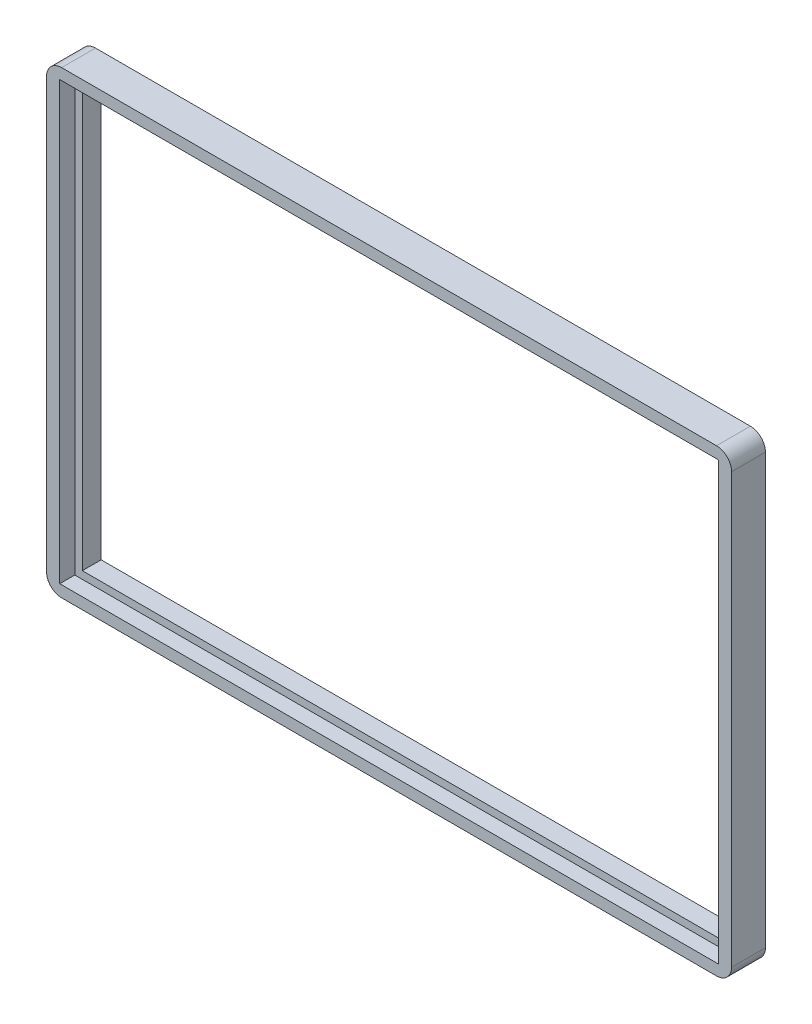
ISO-10303-21;
HEADER;
FILE_DESCRIPTION(('STEP AP214'),'2;1');
FILE_NAME('part.step','',(''),(''),'','','');
FILE_SCHEMA(('AUTOMOTIVE_DESIGN { 1 0 10303 214 1 1 1 1 }'));
ENDSEC;
DATA;
#1=APPLICATION_CONTEXT('core data for automotive mechanical design processes');
#2=APPLICATION_PROTOCOL_DEFINITION('international standard','automotive_design',2000,#1);
#3=PRODUCT_CONTEXT('',#1,'mechanical');
#4=PRODUCT('Part','Part','',(#3));
#5=PRODUCT_RELATED_PRODUCT_CATEGORY('part','',(#4));
#6=PRODUCT_DEFINITION_FORMATION('','',#4);
#7=PRODUCT_DEFINITION_CONTEXT('part definition',#1,'design');
#8=PRODUCT_DEFINITION('design','',#6,#7);
#9=PRODUCT_DEFINITION_SHAPE('','',#8);
#10=(LENGTH_UNIT() NAMED_UNIT(*) SI_UNIT(.MILLI.,.METRE.));
#11=(NAMED_UNIT(*) PLANE_ANGLE_UNIT() SI_UNIT($,.RADIAN.));
#12=(NAMED_UNIT(*) SI_UNIT($,.STERADIAN.) SOLID_ANGLE_UNIT());
#13=UNCERTAINTY_MEASURE_WITH_UNIT(LENGTH_MEASURE(1.E-05),#10,'distance_accuracy_value','');
#14=(GEOMETRIC_REPRESENTATION_CONTEXT(3) GLOBAL_UNCERTAINTY_ASSIGNED_CONTEXT((#13)) GLOBAL_UNIT_ASSIGNED_CONTEXT((#10,
#11,#12)) REPRESENTATION_CONTEXT('',''));
#15=CARTESIAN_POINT('',(0.,0.,0.));
#16=DIRECTION('',(0.,0.,1.));
#17=DIRECTION('',(1.,0.,0.));
#18=AXIS2_PLACEMENT_3D('',#15,#16,#17);
#19=CARTESIAN_POINT('',(45.5,30.5,4.5));
#20=DIRECTION('',(-1.,0.,0.));
#21=DIRECTION('',(0.,-1.,0.));
#22=AXIS2_PLACEMENT_3D('',#19,#20,#21);
#23=PLANE('',#22);
#24=DIRECTION('',(0.,1.,0.));
#25=VECTOR('',#24,1.);
#26=CARTESIAN_POINT('',(45.5,30.5,0.));
#27=LINE('',#26,#25);
#28=CARTESIAN_POINT('',(45.5,-28.5,0.));
#29=VERTEX_POINT('',#28);
#30=CARTESIAN_POINT('',(45.5,28.5,0.));
#31=VERTEX_POINT('',#30);
#32=EDGE_CURVE('E215',#29,#31,#27,.T.);
#33=ORIENTED_EDGE('',*,*,#32,.T.);
#34=DIRECTION('',(0.,0.,-1.));
#35=VECTOR('',#34,1.);
#36=CARTESIAN_POINT('',(45.5,28.5,4.5));
#37=LINE('',#36,#35);
#38=CARTESIAN_POINT('',(45.5,28.5,4.5));
#39=VERTEX_POINT('',#38);
#40=EDGE_CURVE('E258',#31,#39,#37,.F.);
#41=ORIENTED_EDGE('',*,*,#40,.T.);
#42=DIRECTION('',(0.,1.,0.));
#43=VECTOR('',#42,1.);
#44=CARTESIAN_POINT('',(45.5,30.5,4.5));
#45=LINE('',#44,#43);
#46=CARTESIAN_POINT('',(45.5,-28.5,4.5));
#47=VERTEX_POINT('',#46);
#48=EDGE_CURVE('E222',#47,#39,#45,.T.);
#49=ORIENTED_EDGE('',*,*,#48,.F.);
#50=DIRECTION('',(0.,0.,-1.));
#51=VECTOR('',#50,1.);
#52=CARTESIAN_POINT('',(45.5,-28.5,4.5));
#53=LINE('',#52,#51);
#54=EDGE_CURVE('E255',#47,#29,#53,.T.);
#55=ORIENTED_EDGE('',*,*,#54,.T.);
#56=EDGE_LOOP('',(#33,#41,#49,#55));
#57=FACE_BOUND('',#56,.T.);
#58=ADVANCED_FACE('F32',(#57),#23,.F.);
#59=CARTESIAN_POINT('',(-45.5000000000001,30.5,4.5));
#60=DIRECTION('',(0.,-1.,0.));
#61=DIRECTION('',(0.,0.,-1.));
#62=AXIS2_PLACEMENT_3D('',#59,#60,#61);
#63=PLANE('',#62);
#64=DIRECTION('',(-1.,0.,0.));
#65=VECTOR('',#64,1.);
#66=CARTESIAN_POINT('',(-45.5000000000001,30.5,4.5));
#67=LINE('',#66,#65);
#68=CARTESIAN_POINT('',(43.4999999999999,30.5,4.5));
#69=VERTEX_POINT('',#68);
#70=CARTESIAN_POINT('',(-43.5,30.5,4.5));
#71=VERTEX_POINT('',#70);
#72=EDGE_CURVE('E225',#69,#71,#67,.T.);
#73=ORIENTED_EDGE('',*,*,#72,.F.);
#74=DIRECTION('',(0.,0.,-1.));
#75=VECTOR('',#74,1.);
#76=CARTESIAN_POINT('',(43.4999999999999,30.5,4.5));
#77=LINE('',#76,#75);
#78=CARTESIAN_POINT('',(43.4999999999999,30.5,0.));
#79=VERTEX_POINT('',#78);
#80=EDGE_CURVE('E244',#69,#79,#77,.T.);
#81=ORIENTED_EDGE('',*,*,#80,.T.);
#82=DIRECTION('',(-1.,0.,0.));
#83=VECTOR('',#82,1.);
#84=CARTESIAN_POINT('',(-45.5000000000001,30.5,0.));
#85=LINE('',#84,#83);
#86=CARTESIAN_POINT('',(-43.5,30.5,0.));
#87=VERTEX_POINT('',#86);
#88=EDGE_CURVE('E236',#79,#87,#85,.T.);
#89=ORIENTED_EDGE('',*,*,#88,.T.);
#90=DIRECTION('',(0.,0.,-1.));
#91=VECTOR('',#90,1.);
#92=CARTESIAN_POINT('',(-43.5,30.5,4.5));
#93=LINE('',#92,#91);
#94=EDGE_CURVE('E233',#87,#71,#93,.F.);
#95=ORIENTED_EDGE('',*,*,#94,.T.);
#96=EDGE_LOOP('',(#73,#81,#89,#95));
#97=FACE_BOUND('',#96,.T.);
#98=ADVANCED_FACE('F300',(#97),#63,.F.);
#99=CARTESIAN_POINT('',(-45.5000000000001,30.5,4.5));
#100=DIRECTION('',(1.,0.,0.));
#101=DIRECTION('',(0.,1.,0.));
#102=AXIS2_PLACEMENT_3D('',#99,#100,#101);
#103=PLANE('',#102);
#104=DIRECTION('',(0.,-1.,0.));
#105=VECTOR('',#104,1.);
#106=CARTESIAN_POINT('',(-45.5000000000001,30.5,0.));
#107=LINE('',#106,#105);
#108=CARTESIAN_POINT('',(-45.5000000000001,28.5,0.));
#109=VERTEX_POINT('',#108);
#110=CARTESIAN_POINT('',(-45.5,-28.5,0.));
#111=VERTEX_POINT('',#110);
#112=EDGE_CURVE('E239',#109,#111,#107,.T.);
#113=ORIENTED_EDGE('',*,*,#112,.T.);
#114=DIRECTION('',(0.,0.,-1.));
#115=VECTOR('',#114,1.);
#116=CARTESIAN_POINT('',(-45.5,-28.5,4.5));
#117=LINE('',#116,#115);
#118=CARTESIAN_POINT('',(-45.5,-28.5,4.5));
#119=VERTEX_POINT('',#118);
#120=EDGE_CURVE('E11',#111,#119,#117,.F.);
#121=ORIENTED_EDGE('',*,*,#120,.T.);
#122=DIRECTION('',(0.,-1.,0.));
#123=VECTOR('',#122,1.);
#124=CARTESIAN_POINT('',(-45.5000000000001,30.5,4.5));
#125=LINE('',#124,#123);
#126=CARTESIAN_POINT('',(-45.5000000000001,28.5,4.5));
#127=VERTEX_POINT('',#126);
#128=EDGE_CURVE('E229',#127,#119,#125,.T.);
#129=ORIENTED_EDGE('',*,*,#128,.F.);
#130=DIRECTION('',(0.,0.,-1.));
#131=VECTOR('',#130,1.);
#132=CARTESIAN_POINT('',(-45.5000000000001,28.5,4.5));
#133=LINE('',#132,#131);
#134=EDGE_CURVE('E40',#127,#109,#133,.T.);
#135=ORIENTED_EDGE('',*,*,#134,.T.);
#136=EDGE_LOOP('',(#113,#121,#129,#135));
#137=FACE_BOUND('',#136,.T.);
#138=ADVANCED_FACE('F275',(#137),#103,.F.);
#139=CARTESIAN_POINT('',(-45.5,-30.5,4.5));
#140=DIRECTION('',(0.,1.,0.));
#141=DIRECTION('',(0.,0.,1.));
#142=AXIS2_PLACEMENT_3D('',#139,#140,#141);
#143=PLANE('',#142);
#144=DIRECTION('',(1.,0.,0.));
#145=VECTOR('',#144,1.);
#146=CARTESIAN_POINT('',(-45.5,-30.5,0.));
#147=LINE('',#146,#145);
#148=CARTESIAN_POINT('',(-43.5,-30.5,0.));
#149=VERTEX_POINT('',#148);
#150=CARTESIAN_POINT('',(43.5,-30.5,0.));
#151=VERTEX_POINT('',#150);
#152=EDGE_CURVE('E226',#149,#151,#147,.T.);
#153=ORIENTED_EDGE('',*,*,#152,.T.);
#154=DIRECTION('',(0.,0.,-1.));
#155=VECTOR('',#154,1.);
#156=CARTESIAN_POINT('',(43.5,-30.5,4.5));
#157=LINE('',#156,#155);
#158=CARTESIAN_POINT('',(43.5,-30.5,4.5));
#159=VERTEX_POINT('',#158);
#160=EDGE_CURVE('E47',#151,#159,#157,.F.);
#161=ORIENTED_EDGE('',*,*,#160,.T.);
#162=DIRECTION('',(1.,0.,0.));
#163=VECTOR('',#162,1.);
#164=CARTESIAN_POINT('',(-45.5,-30.5,4.5));
#165=LINE('',#164,#163);
#166=CARTESIAN_POINT('',(-43.5,-30.5,4.5));
#167=VERTEX_POINT('',#166);
#168=EDGE_CURVE('E231',#167,#159,#165,.T.);
#169=ORIENTED_EDGE('',*,*,#168,.F.);
#170=DIRECTION('',(0.,0.,-1.));
#171=VECTOR('',#170,1.);
#172=CARTESIAN_POINT('',(-43.5,-30.5,4.5));
#173=LINE('',#172,#171);
#174=EDGE_CURVE('E267',#167,#149,#173,.T.);
#175=ORIENTED_EDGE('',*,*,#174,.T.);
#176=EDGE_LOOP('',(#153,#161,#169,#175));
#177=FACE_BOUND('',#176,.T.);
#178=ADVANCED_FACE('F284',(#177),#143,.F.);
#179=CARTESIAN_POINT('',(0.,0.,4.5));
#180=DIRECTION('',(0.,0.,1.));
#181=DIRECTION('',(1.,0.,0.));
#182=AXIS2_PLACEMENT_3D('',#179,#180,#181);
#183=PLANE('',#182);
#184=DIRECTION('',(0.,1.,0.));
#185=VECTOR('',#184,1.);
#186=CARTESIAN_POINT('',(43.75,29.,4.5));
#187=LINE('',#186,#185);
#188=CARTESIAN_POINT('',(43.75,-29.,4.5));
#189=VERTEX_POINT('',#188);
#190=CARTESIAN_POINT('',(43.75,29.,4.5));
#191=VERTEX_POINT('',#190);
#192=EDGE_CURVE('E185',#189,#191,#187,.T.);
#193=ORIENTED_EDGE('',*,*,#192,.F.);
#194=DIRECTION('',(1.,0.,0.));
#195=VECTOR('',#194,1.);
#196=CARTESIAN_POINT('',(-43.75,-29.,4.5));
#197=LINE('',#196,#195);
#198=CARTESIAN_POINT('',(-43.75,-29.,4.5));
#199=VERTEX_POINT('',#198);
#200=EDGE_CURVE('E194',#199,#189,#197,.T.);
#201=ORIENTED_EDGE('',*,*,#200,.F.);
#202=DIRECTION('',(0.,-1.,0.));
#203=VECTOR('',#202,1.);
#204=CARTESIAN_POINT('',(-43.75,29.,4.5));
#205=LINE('',#204,#203);
#206=CARTESIAN_POINT('',(-43.75,29.,4.5));
#207=VERTEX_POINT('',#206);
#208=EDGE_CURVE('E208',#207,#199,#205,.T.);
#209=ORIENTED_EDGE('',*,*,#208,.F.);
#210=DIRECTION('',(-1.,0.,0.));
#211=VECTOR('',#210,1.);
#212=CARTESIAN_POINT('',(-43.75,29.,4.5));
#213=LINE('',#212,#211);
#214=EDGE_CURVE('E205',#191,#207,#213,.T.);
#215=ORIENTED_EDGE('',*,*,#214,.F.);
#216=EDGE_LOOP('',(#193,#201,#209,#215));
#217=FACE_BOUND('',#216,.T.);
#218=ORIENTED_EDGE('',*,*,#48,.T.);
#219=CARTESIAN_POINT('',(43.4999999999999,28.5,4.5));
#220=DIRECTION('',(0.,0.,1.));
#221=DIRECTION('',(1.,0.,0.));
#222=AXIS2_PLACEMENT_3D('',#219,#220,#221);
#223=CIRCLE('',#222,2.);
#224=EDGE_CURVE('E265',#39,#69,#223,.T.);
#225=ORIENTED_EDGE('',*,*,#224,.T.);
#226=ORIENTED_EDGE('',*,*,#72,.T.);
#227=CARTESIAN_POINT('',(-43.5,28.5,4.5));
#228=DIRECTION('',(0.,0.,1.));
#229=DIRECTION('',(1.,0.,0.));
#230=AXIS2_PLACEMENT_3D('',#227,#228,#229);
#231=CIRCLE('',#230,2.);
#232=EDGE_CURVE('E260',#71,#127,#231,.T.);
#233=ORIENTED_EDGE('',*,*,#232,.T.);
#234=ORIENTED_EDGE('',*,*,#128,.T.);
#235=CARTESIAN_POINT('',(-43.5,-28.5,4.5));
#236=DIRECTION('',(0.,0.,1.));
#237=DIRECTION('',(1.,0.,0.));
#238=AXIS2_PLACEMENT_3D('',#235,#236,#237);
#239=CIRCLE('',#238,2.);
#240=EDGE_CURVE('E54',#119,#167,#239,.T.);
#241=ORIENTED_EDGE('',*,*,#240,.T.);
#242=ORIENTED_EDGE('',*,*,#168,.T.);
#243=CARTESIAN_POINT('',(43.5,-28.5,4.5));
#244=DIRECTION('',(0.,0.,1.));
#245=DIRECTION('',(1.,0.,0.));
#246=AXIS2_PLACEMENT_3D('',#243,#244,#245);
#247=CIRCLE('',#246,2.);
#248=EDGE_CURVE('E263',#159,#47,#247,.T.);
#249=ORIENTED_EDGE('',*,*,#248,.T.);
#250=EDGE_LOOP('',(#218,#225,#226,#233,#234,#241,#242,#249));
#251=FACE_BOUND('',#250,.T.);
#252=ADVANCED_FACE('F286',(#217,#251),#183,.T.);
#253=CARTESIAN_POINT('',(0.,0.,0.));
#254=DIRECTION('',(0.,0.,1.));
#255=DIRECTION('',(1.,0.,0.));
#256=AXIS2_PLACEMENT_3D('',#253,#254,#255);
#257=PLANE('',#256);
#258=DIRECTION('',(1.,0.,0.));
#259=VECTOR('',#258,1.);
#260=CARTESIAN_POINT('',(-42.75,-28.,0.));
#261=LINE('',#260,#259);
#262=CARTESIAN_POINT('',(-42.75,-28.,0.));
#263=VERTEX_POINT('',#262);
#264=CARTESIAN_POINT('',(42.75,-28.,0.));
#265=VERTEX_POINT('',#264);
#266=EDGE_CURVE('E158',#263,#265,#261,.T.);
#267=ORIENTED_EDGE('',*,*,#266,.T.);
#268=DIRECTION('',(0.,1.,0.));
#269=VECTOR('',#268,1.);
#270=CARTESIAN_POINT('',(42.75,28.,0.));
#271=LINE('',#270,#269);
#272=CARTESIAN_POINT('',(42.75,28.,0.));
#273=VERTEX_POINT('',#272);
#274=EDGE_CURVE('E150',#265,#273,#271,.T.);
#275=ORIENTED_EDGE('',*,*,#274,.T.);
#276=DIRECTION('',(-1.,0.,0.));
#277=VECTOR('',#276,1.);
#278=CARTESIAN_POINT('',(-42.75,28.,0.));
#279=LINE('',#278,#277);
#280=CARTESIAN_POINT('',(-42.75,28.,0.));
#281=VERTEX_POINT('',#280);
#282=EDGE_CURVE('E162',#273,#281,#279,.T.);
#283=ORIENTED_EDGE('',*,*,#282,.T.);
#284=DIRECTION('',(0.,-1.,0.));
#285=VECTOR('',#284,1.);
#286=CARTESIAN_POINT('',(-42.75,28.,0.));
#287=LINE('',#286,#285);
#288=EDGE_CURVE('E166',#281,#263,#287,.T.);
#289=ORIENTED_EDGE('',*,*,#288,.T.);
#290=EDGE_LOOP('',(#267,#275,#283,#289));
#291=FACE_BOUND('',#290,.T.);
#292=ORIENTED_EDGE('',*,*,#88,.F.);
#293=CARTESIAN_POINT('',(43.4999999999999,28.5,0.));
#294=DIRECTION('',(0.,0.,1.));
#295=DIRECTION('',(1.,0.,0.));
#296=AXIS2_PLACEMENT_3D('',#293,#294,#295);
#297=CIRCLE('',#296,2.);
#298=EDGE_CURVE('E253',#79,#31,#297,.F.);
#299=ORIENTED_EDGE('',*,*,#298,.T.);
#300=ORIENTED_EDGE('',*,*,#32,.F.);
#301=CARTESIAN_POINT('',(43.5,-28.5,0.));
#302=DIRECTION('',(0.,0.,1.));
#303=DIRECTION('',(1.,0.,0.));
#304=AXIS2_PLACEMENT_3D('',#301,#302,#303);
#305=CIRCLE('',#304,2.);
#306=EDGE_CURVE('E251',#29,#151,#305,.F.);
#307=ORIENTED_EDGE('',*,*,#306,.T.);
#308=ORIENTED_EDGE('',*,*,#152,.F.);
#309=CARTESIAN_POINT('',(-43.5,-28.5,0.));
#310=DIRECTION('',(0.,0.,1.));
#311=DIRECTION('',(1.,0.,0.));
#312=AXIS2_PLACEMENT_3D('',#309,#310,#311);
#313=CIRCLE('',#312,2.);
#314=EDGE_CURVE('E249',#149,#111,#313,.F.);
#315=ORIENTED_EDGE('',*,*,#314,.T.);
#316=ORIENTED_EDGE('',*,*,#112,.F.);
#317=CARTESIAN_POINT('',(-43.5,28.5,0.));
#318=DIRECTION('',(0.,0.,1.));
#319=DIRECTION('',(1.,0.,0.));
#320=AXIS2_PLACEMENT_3D('',#317,#318,#319);
#321=CIRCLE('',#320,2.);
#322=EDGE_CURVE('E247',#109,#87,#321,.F.);
#323=ORIENTED_EDGE('',*,*,#322,.T.);
#324=EDGE_LOOP('',(#292,#299,#300,#307,#308,#315,#316,#323));
#325=FACE_BOUND('',#324,.T.);
#326=ADVANCED_FACE('F168',(#291,#325),#257,.F.);
#327=CARTESIAN_POINT('',(43.75,29.,2.5));
#328=DIRECTION('',(1.,0.,0.));
#329=DIRECTION('',(0.,1.,0.));
#330=AXIS2_PLACEMENT_3D('',#327,#328,#329);
#331=PLANE('',#330);
#332=ORIENTED_EDGE('',*,*,#192,.T.);
#333=DIRECTION('',(0.,0.,1.));
#334=VECTOR('',#333,1.);
#335=CARTESIAN_POINT('',(43.75,29.,2.5));
#336=LINE('',#335,#334);
#337=CARTESIAN_POINT('',(43.75,29.,2.5));
#338=VERTEX_POINT('',#337);
#339=EDGE_CURVE('E203',#338,#191,#336,.T.);
#340=ORIENTED_EDGE('',*,*,#339,.F.);
#341=DIRECTION('',(0.,1.,0.));
#342=VECTOR('',#341,1.);
#343=CARTESIAN_POINT('',(43.75,29.,2.5));
#344=LINE('',#343,#342);
#345=CARTESIAN_POINT('',(43.75,-29.,2.5));
#346=VERTEX_POINT('',#345);
#347=EDGE_CURVE('E190',#346,#338,#344,.T.);
#348=ORIENTED_EDGE('',*,*,#347,.F.);
#349=DIRECTION('',(0.,0.,1.));
#350=VECTOR('',#349,1.);
#351=CARTESIAN_POINT('',(43.75,-29.,2.5));
#352=LINE('',#351,#350);
#353=EDGE_CURVE('E213',#346,#189,#352,.T.);
#354=ORIENTED_EDGE('',*,*,#353,.T.);
#355=EDGE_LOOP('',(#332,#340,#348,#354));
#356=FACE_BOUND('',#355,.T.);
#357=ADVANCED_FACE('F406',(#356),#331,.F.);
#358=CARTESIAN_POINT('',(-43.75,-29.,2.5));
#359=DIRECTION('',(0.,-1.,0.));
#360=DIRECTION('',(0.,0.,-1.));
#361=AXIS2_PLACEMENT_3D('',#358,#359,#360);
#362=PLANE('',#361);
#363=ORIENTED_EDGE('',*,*,#200,.T.);
#364=ORIENTED_EDGE('',*,*,#353,.F.);
#365=DIRECTION('',(1.,0.,0.));
#366=VECTOR('',#365,1.);
#367=CARTESIAN_POINT('',(-43.75,-29.,2.5));
#368=LINE('',#367,#366);
#369=CARTESIAN_POINT('',(-43.75,-29.,2.5));
#370=VERTEX_POINT('',#369);
#371=EDGE_CURVE('E200',#370,#346,#368,.T.);
#372=ORIENTED_EDGE('',*,*,#371,.F.);
#373=DIRECTION('',(0.,0.,1.));
#374=VECTOR('',#373,1.);
#375=CARTESIAN_POINT('',(-43.75,-29.,2.5));
#376=LINE('',#375,#374);
#377=EDGE_CURVE('E216',#370,#199,#376,.T.);
#378=ORIENTED_EDGE('',*,*,#377,.T.);
#379=EDGE_LOOP('',(#363,#364,#372,#378));
#380=FACE_BOUND('',#379,.T.);
#381=ADVANCED_FACE('F397',(#380),#362,.F.);
#382=CARTESIAN_POINT('',(-43.75,29.,2.5));
#383=DIRECTION('',(-1.,0.,0.));
#384=DIRECTION('',(0.,-1.,0.));
#385=AXIS2_PLACEMENT_3D('',#382,#383,#384);
#386=PLANE('',#385);
#387=ORIENTED_EDGE('',*,*,#208,.T.);
#388=ORIENTED_EDGE('',*,*,#377,.F.);
#389=DIRECTION('',(0.,-1.,0.));
#390=VECTOR('',#389,1.);
#391=CARTESIAN_POINT('',(-43.75,29.,2.5));
#392=LINE('',#391,#390);
#393=CARTESIAN_POINT('',(-43.75,29.,2.5));
#394=VERTEX_POINT('',#393);
#395=EDGE_CURVE('E197',#394,#370,#392,.T.);
#396=ORIENTED_EDGE('',*,*,#395,.F.);
#397=DIRECTION('',(0.,0.,1.));
#398=VECTOR('',#397,1.);
#399=CARTESIAN_POINT('',(-43.75,29.,2.5));
#400=LINE('',#399,#398);
#401=EDGE_CURVE('E218',#394,#207,#400,.T.);
#402=ORIENTED_EDGE('',*,*,#401,.T.);
#403=EDGE_LOOP('',(#387,#388,#396,#402));
#404=FACE_BOUND('',#403,.T.);
#405=ADVANCED_FACE('F388',(#404),#386,.F.);
#406=CARTESIAN_POINT('',(-43.75,29.,2.5));
#407=DIRECTION('',(0.,1.,0.));
#408=DIRECTION('',(0.,0.,1.));
#409=AXIS2_PLACEMENT_3D('',#406,#407,#408);
#410=PLANE('',#409);
#411=ORIENTED_EDGE('',*,*,#214,.T.);
#412=ORIENTED_EDGE('',*,*,#401,.F.);
#413=DIRECTION('',(-1.,0.,0.));
#414=VECTOR('',#413,1.);
#415=CARTESIAN_POINT('',(-43.75,29.,2.5));
#416=LINE('',#415,#414);
#417=EDGE_CURVE('E193',#338,#394,#416,.T.);
#418=ORIENTED_EDGE('',*,*,#417,.F.);
#419=ORIENTED_EDGE('',*,*,#339,.T.);
#420=EDGE_LOOP('',(#411,#412,#418,#419));
#421=FACE_BOUND('',#420,.T.);
#422=ADVANCED_FACE('F379',(#421),#410,.F.);
#423=CARTESIAN_POINT('',(0.,0.,2.5));
#424=DIRECTION('',(0.,0.,1.));
#425=DIRECTION('',(1.,0.,0.));
#426=AXIS2_PLACEMENT_3D('',#423,#424,#425);
#427=PLANE('',#426);
#428=DIRECTION('',(0.,1.,0.));
#429=VECTOR('',#428,1.);
#430=CARTESIAN_POINT('',(42.75,28.,2.5));
#431=LINE('',#430,#429);
#432=CARTESIAN_POINT('',(42.75,-28.,2.5));
#433=VERTEX_POINT('',#432);
#434=CARTESIAN_POINT('',(42.75,28.,2.5));
#435=VERTEX_POINT('',#434);
#436=EDGE_CURVE('E153',#433,#435,#431,.T.);
#437=ORIENTED_EDGE('',*,*,#436,.F.);
#438=DIRECTION('',(1.,0.,0.));
#439=VECTOR('',#438,1.);
#440=CARTESIAN_POINT('',(-42.75,-28.,2.5));
#441=LINE('',#440,#439);
#442=CARTESIAN_POINT('',(-42.75,-28.,2.5));
#443=VERTEX_POINT('',#442);
#444=EDGE_CURVE('E171',#443,#433,#441,.T.);
#445=ORIENTED_EDGE('',*,*,#444,.F.);
#446=DIRECTION('',(0.,-1.,0.));
#447=VECTOR('',#446,1.);
#448=CARTESIAN_POINT('',(-42.75,28.,2.5));
#449=LINE('',#448,#447);
#450=CARTESIAN_POINT('',(-42.75,28.,2.5));
#451=VERTEX_POINT('',#450);
#452=EDGE_CURVE('E174',#451,#443,#449,.T.);
#453=ORIENTED_EDGE('',*,*,#452,.F.);
#454=DIRECTION('',(-1.,0.,0.));
#455=VECTOR('',#454,1.);
#456=CARTESIAN_POINT('',(-42.75,28.,2.5));
#457=LINE('',#456,#455);
#458=EDGE_CURVE('E180',#435,#451,#457,.T.);
#459=ORIENTED_EDGE('',*,*,#458,.F.);
#460=EDGE_LOOP('',(#437,#445,#453,#459));
#461=FACE_BOUND('',#460,.T.);
#462=ORIENTED_EDGE('',*,*,#347,.T.);
#463=ORIENTED_EDGE('',*,*,#417,.T.);
#464=ORIENTED_EDGE('',*,*,#395,.T.);
#465=ORIENTED_EDGE('',*,*,#371,.T.);
#466=EDGE_LOOP('',(#462,#463,#464,#465));
#467=FACE_BOUND('',#466,.T.);
#468=ADVANCED_FACE('F371',(#461,#467),#427,.T.);
#469=CARTESIAN_POINT('',(42.75,28.,0.));
#470=DIRECTION('',(1.,0.,0.));
#471=DIRECTION('',(0.,0.,-1.));
#472=AXIS2_PLACEMENT_3D('',#469,#470,#471);
#473=PLANE('',#472);
#474=ORIENTED_EDGE('',*,*,#436,.T.);
#475=DIRECTION('',(0.,0.,1.));
#476=VECTOR('',#475,1.);
#477=CARTESIAN_POINT('',(42.75,28.,0.));
#478=LINE('',#477,#476);
#479=EDGE_CURVE('E146',#273,#435,#478,.T.);
#480=ORIENTED_EDGE('',*,*,#479,.F.);
#481=ORIENTED_EDGE('',*,*,#274,.F.);
#482=DIRECTION('',(0.,0.,1.));
#483=VECTOR('',#482,1.);
#484=CARTESIAN_POINT('',(42.75,-28.,0.));
#485=LINE('',#484,#483);
#486=EDGE_CURVE('E183',#265,#433,#485,.T.);
#487=ORIENTED_EDGE('',*,*,#486,.T.);
#488=EDGE_LOOP('',(#474,#480,#481,#487));
#489=FACE_BOUND('',#488,.T.);
#490=ADVANCED_FACE('F148',(#489),#473,.F.);
#491=CARTESIAN_POINT('',(-42.75,-28.,0.));
#492=DIRECTION('',(0.,-1.,0.));
#493=DIRECTION('',(0.,0.,-1.));
#494=AXIS2_PLACEMENT_3D('',#491,#492,#493);
#495=PLANE('',#494);
#496=ORIENTED_EDGE('',*,*,#444,.T.);
#497=ORIENTED_EDGE('',*,*,#486,.F.);
#498=ORIENTED_EDGE('',*,*,#266,.F.);
#499=DIRECTION('',(0.,0.,1.));
#500=VECTOR('',#499,1.);
#501=CARTESIAN_POINT('',(-42.75,-28.,0.));
#502=LINE('',#501,#500);
#503=EDGE_CURVE('E186',#263,#443,#502,.T.);
#504=ORIENTED_EDGE('',*,*,#503,.T.);
#505=EDGE_LOOP('',(#496,#497,#498,#504));
#506=FACE_BOUND('',#505,.T.);
#507=ADVANCED_FACE('F354',(#506),#495,.F.);
#508=CARTESIAN_POINT('',(-42.75,28.,0.));
#509=DIRECTION('',(-1.,0.,0.));
#510=DIRECTION('',(0.,0.,1.));
#511=AXIS2_PLACEMENT_3D('',#508,#509,#510);
#512=PLANE('',#511);
#513=ORIENTED_EDGE('',*,*,#452,.T.);
#514=ORIENTED_EDGE('',*,*,#503,.F.);
#515=ORIENTED_EDGE('',*,*,#288,.F.);
#516=DIRECTION('',(0.,0.,1.));
#517=VECTOR('',#516,1.);
#518=CARTESIAN_POINT('',(-42.75,28.,0.));
#519=LINE('',#518,#517);
#520=EDGE_CURVE('E157',#281,#451,#519,.T.);
#521=ORIENTED_EDGE('',*,*,#520,.T.);
#522=EDGE_LOOP('',(#513,#514,#515,#521));
#523=FACE_BOUND('',#522,.T.);
#524=ADVANCED_FACE('F346',(#523),#512,.F.);
#525=CARTESIAN_POINT('',(-42.75,28.,0.));
#526=DIRECTION('',(0.,1.,0.));
#527=DIRECTION('',(0.,0.,1.));
#528=AXIS2_PLACEMENT_3D('',#525,#526,#527);
#529=PLANE('',#528);
#530=ORIENTED_EDGE('',*,*,#458,.T.);
#531=ORIENTED_EDGE('',*,*,#520,.F.);
#532=ORIENTED_EDGE('',*,*,#282,.F.);
#533=ORIENTED_EDGE('',*,*,#479,.T.);
#534=EDGE_LOOP('',(#530,#531,#532,#533));
#535=FACE_BOUND('',#534,.T.);
#536=ADVANCED_FACE('F163',(#535),#529,.F.);
#537=CARTESIAN_POINT('',(43.4999999999999,28.5,4.5));
#538=DIRECTION('',(0.,0.,-1.));
#539=DIRECTION('',(-1.,0.,0.));
#540=AXIS2_PLACEMENT_3D('',#537,#538,#539);
#541=CYLINDRICAL_SURFACE('',#540,2.);
#542=ORIENTED_EDGE('',*,*,#224,.F.);
#543=ORIENTED_EDGE('',*,*,#40,.F.);
#544=ORIENTED_EDGE('',*,*,#298,.F.);
#545=ORIENTED_EDGE('',*,*,#80,.F.);
#546=EDGE_LOOP('',(#542,#543,#544,#545));
#547=FACE_BOUND('',#546,.T.);
#548=ADVANCED_FACE('F297',(#547),#541,.T.);
#549=CARTESIAN_POINT('',(43.5,-28.5,4.5));
#550=DIRECTION('',(0.,0.,-1.));
#551=DIRECTION('',(-1.,0.,0.));
#552=AXIS2_PLACEMENT_3D('',#549,#550,#551);
#553=CYLINDRICAL_SURFACE('',#552,2.);
#554=ORIENTED_EDGE('',*,*,#248,.F.);
#555=ORIENTED_EDGE('',*,*,#160,.F.);
#556=ORIENTED_EDGE('',*,*,#306,.F.);
#557=ORIENTED_EDGE('',*,*,#54,.F.);
#558=EDGE_LOOP('',(#554,#555,#556,#557));
#559=FACE_BOUND('',#558,.T.);
#560=ADVANCED_FACE('F290',(#559),#553,.T.);
#561=CARTESIAN_POINT('',(-43.5,-28.5,4.5));
#562=DIRECTION('',(0.,0.,-1.));
#563=DIRECTION('',(-1.,0.,0.));
#564=AXIS2_PLACEMENT_3D('',#561,#562,#563);
#565=CYLINDRICAL_SURFACE('',#564,2.);
#566=ORIENTED_EDGE('',*,*,#240,.F.);
#567=ORIENTED_EDGE('',*,*,#120,.F.);
#568=ORIENTED_EDGE('',*,*,#314,.F.);
#569=ORIENTED_EDGE('',*,*,#174,.F.);
#570=EDGE_LOOP('',(#566,#567,#568,#569));
#571=FACE_BOUND('',#570,.T.);
#572=ADVANCED_FACE('F283',(#571),#565,.T.);
#573=CARTESIAN_POINT('',(-43.5,28.5,4.5));
#574=DIRECTION('',(0.,0.,-1.));
#575=DIRECTION('',(-1.,0.,0.));
#576=AXIS2_PLACEMENT_3D('',#573,#574,#575);
#577=CYLINDRICAL_SURFACE('',#576,2.);
#578=ORIENTED_EDGE('',*,*,#232,.F.);
#579=ORIENTED_EDGE('',*,*,#94,.F.);
#580=ORIENTED_EDGE('',*,*,#322,.F.);
#581=ORIENTED_EDGE('',*,*,#134,.F.);
#582=EDGE_LOOP('',(#578,#579,#580,#581));
#583=FACE_BOUND('',#582,.T.);
#584=ADVANCED_FACE('F34',(#583),#577,.T.);
#585=CLOSED_SHELL('',(#58,#98,#138,#178,#252,#326,#357,#381,#405,#422,#468,#490,#507,#524,#536,
#548,#560,#572,#584));
#586=MANIFOLD_SOLID_BREP('B2',#585);
#587=ADVANCED_BREP_SHAPE_REPRESENTATION('',(#18,#586),#14);
#588=SHAPE_DEFINITION_REPRESENTATION(#9,#587);
ENDSEC;
END-ISO-10303-21;
